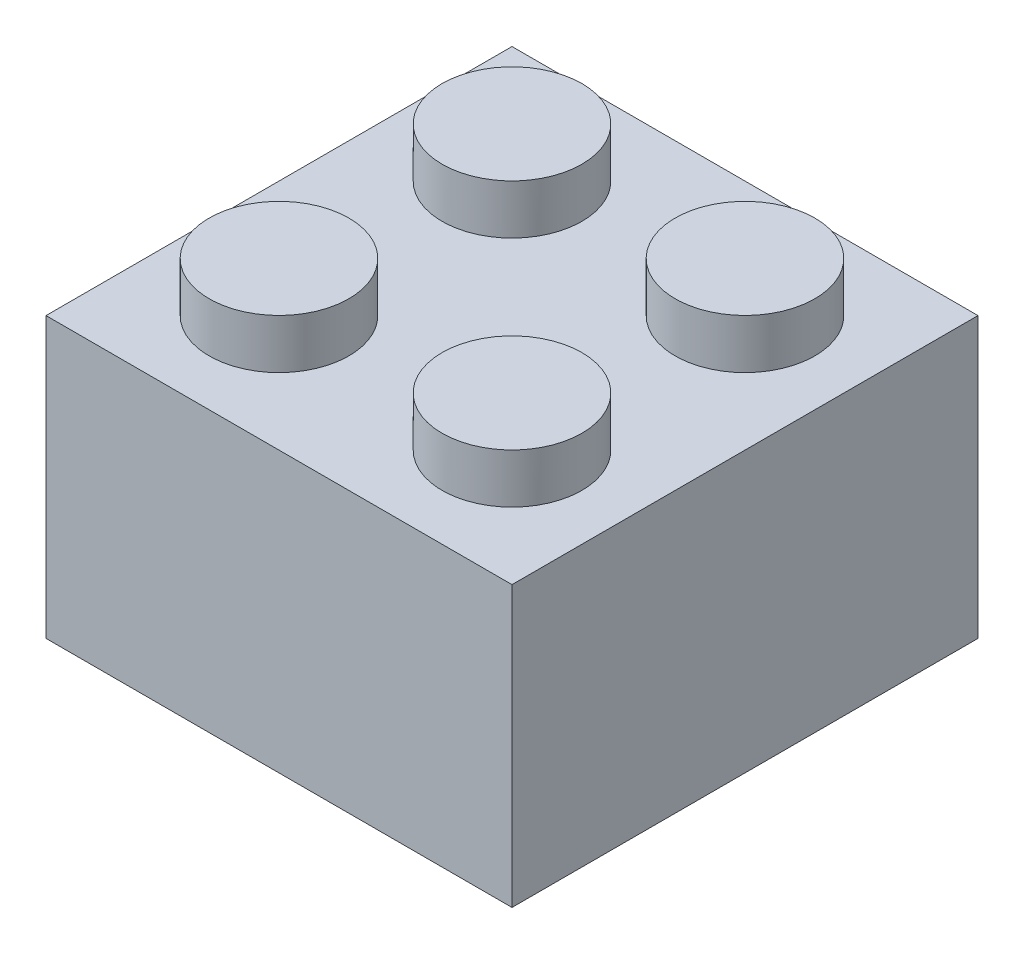
ISO-10303-21;
HEADER;
FILE_DESCRIPTION(('STEP AP214'),'2;1');
FILE_NAME('part.step','',(''),(''),'','','');
FILE_SCHEMA(('AUTOMOTIVE_DESIGN { 1 0 10303 214 1 1 1 1 }'));
ENDSEC;
DATA;
#1=APPLICATION_CONTEXT('core data for automotive mechanical design processes');
#2=APPLICATION_PROTOCOL_DEFINITION('international standard','automotive_design',2000,#1);
#3=PRODUCT_CONTEXT('',#1,'mechanical');
#4=PRODUCT('Part','Part','',(#3));
#5=PRODUCT_RELATED_PRODUCT_CATEGORY('part','',(#4));
#6=PRODUCT_DEFINITION_FORMATION('','',#4);
#7=PRODUCT_DEFINITION_CONTEXT('part definition',#1,'design');
#8=PRODUCT_DEFINITION('design','',#6,#7);
#9=PRODUCT_DEFINITION_SHAPE('','',#8);
#10=(LENGTH_UNIT() NAMED_UNIT(*) SI_UNIT(.MILLI.,.METRE.));
#11=(NAMED_UNIT(*) PLANE_ANGLE_UNIT() SI_UNIT($,.RADIAN.));
#12=(NAMED_UNIT(*) SI_UNIT($,.STERADIAN.) SOLID_ANGLE_UNIT());
#13=UNCERTAINTY_MEASURE_WITH_UNIT(LENGTH_MEASURE(1.E-05),#10,'distance_accuracy_value','');
#14=(GEOMETRIC_REPRESENTATION_CONTEXT(3) GLOBAL_UNCERTAINTY_ASSIGNED_CONTEXT((#13)) GLOBAL_UNIT_ASSIGNED_CONTEXT((#10,
#11,#12)) REPRESENTATION_CONTEXT('',''));
#15=CARTESIAN_POINT('',(0.,0.,0.));
#16=DIRECTION('',(0.,0.,1.));
#17=DIRECTION('',(1.,0.,0.));
#18=AXIS2_PLACEMENT_3D('',#15,#16,#17);
#19=CARTESIAN_POINT('',(0.,0.,0.));
#20=DIRECTION('',(0.,-1.,0.));
#21=DIRECTION('',(0.,0.,-1.));
#22=AXIS2_PLACEMENT_3D('',#19,#20,#21);
#23=PLANE('',#22);
#24=DIRECTION('',(0.,0.,-1.));
#25=VECTOR('',#24,1.);
#26=CARTESIAN_POINT('',(8.,0.,8.));
#27=LINE('',#26,#25);
#28=CARTESIAN_POINT('',(8.,0.,8.));
#29=VERTEX_POINT('',#28);
#30=CARTESIAN_POINT('',(8.,0.,-8.));
#31=VERTEX_POINT('',#30);
#32=EDGE_CURVE('E187',#29,#31,#27,.T.);
#33=ORIENTED_EDGE('',*,*,#32,.F.);
#34=DIRECTION('',(1.,0.,0.));
#35=VECTOR('',#34,1.);
#36=CARTESIAN_POINT('',(-8.,0.,8.));
#37=LINE('',#36,#35);
#38=CARTESIAN_POINT('',(-8.,0.,8.));
#39=VERTEX_POINT('',#38);
#40=EDGE_CURVE('E78',#39,#29,#37,.T.);
#41=ORIENTED_EDGE('',*,*,#40,.F.);
#42=DIRECTION('',(0.,0.,1.));
#43=VECTOR('',#42,1.);
#44=CARTESIAN_POINT('',(-8.,0.,8.));
#45=LINE('',#44,#43);
#46=CARTESIAN_POINT('',(-8.,0.,-8.));
#47=VERTEX_POINT('',#46);
#48=EDGE_CURVE('E199',#47,#39,#45,.T.);
#49=ORIENTED_EDGE('',*,*,#48,.F.);
#50=DIRECTION('',(-1.,0.,0.));
#51=VECTOR('',#50,1.);
#52=CARTESIAN_POINT('',(-8.,0.,-8.));
#53=LINE('',#52,#51);
#54=EDGE_CURVE('E197',#31,#47,#53,.T.);
#55=ORIENTED_EDGE('',*,*,#54,.F.);
#56=EDGE_LOOP('',(#33,#41,#49,#55));
#57=FACE_BOUND('',#56,.T.);
#58=DIRECTION('',(1.,0.,0.));
#59=VECTOR('',#58,1.);
#60=CARTESIAN_POINT('',(0.,0.,6.4));
#61=LINE('',#60,#59);
#62=CARTESIAN_POINT('',(-6.4,0.,6.4));
#63=VERTEX_POINT('',#62);
#64=CARTESIAN_POINT('',(6.4,0.,6.4));
#65=VERTEX_POINT('',#64);
#66=EDGE_CURVE('E126',#63,#65,#61,.T.);
#67=ORIENTED_EDGE('',*,*,#66,.T.);
#68=DIRECTION('',(0.,0.,-1.));
#69=VECTOR('',#68,1.);
#70=CARTESIAN_POINT('',(6.4,0.,0.));
#71=LINE('',#70,#69);
#72=CARTESIAN_POINT('',(6.4,0.,-6.4));
#73=VERTEX_POINT('',#72);
#74=EDGE_CURVE('E160',#65,#73,#71,.T.);
#75=ORIENTED_EDGE('',*,*,#74,.T.);
#76=DIRECTION('',(-1.,0.,0.));
#77=VECTOR('',#76,1.);
#78=CARTESIAN_POINT('',(0.,0.,-6.4));
#79=LINE('',#78,#77);
#80=CARTESIAN_POINT('',(-6.4,0.,-6.4));
#81=VERTEX_POINT('',#80);
#82=EDGE_CURVE('E130',#73,#81,#79,.T.);
#83=ORIENTED_EDGE('',*,*,#82,.T.);
#84=DIRECTION('',(0.,0.,1.));
#85=VECTOR('',#84,1.);
#86=CARTESIAN_POINT('',(-6.4,0.,0.));
#87=LINE('',#86,#85);
#88=EDGE_CURVE('E48',#81,#63,#87,.T.);
#89=ORIENTED_EDGE('',*,*,#88,.T.);
#90=EDGE_LOOP('',(#67,#75,#83,#89));
#91=FACE_BOUND('',#90,.T.);
#92=ADVANCED_FACE('F33',(#57,#91),#23,.T.);
#93=CARTESIAN_POINT('',(8.,9.6,8.));
#94=DIRECTION('',(-1.,0.,0.));
#95=DIRECTION('',(0.,0.,1.));
#96=AXIS2_PLACEMENT_3D('',#93,#94,#95);
#97=PLANE('',#96);
#98=ORIENTED_EDGE('',*,*,#32,.T.);
#99=DIRECTION('',(0.,-1.,0.));
#100=VECTOR('',#99,1.);
#101=CARTESIAN_POINT('',(8.,9.6,-8.));
#102=LINE('',#101,#100);
#103=CARTESIAN_POINT('',(8.,9.6,-8.));
#104=VERTEX_POINT('',#103);
#105=EDGE_CURVE('E208',#104,#31,#102,.T.);
#106=ORIENTED_EDGE('',*,*,#105,.F.);
#107=DIRECTION('',(0.,0.,-1.));
#108=VECTOR('',#107,1.);
#109=CARTESIAN_POINT('',(8.,9.6,8.));
#110=LINE('',#109,#108);
#111=CARTESIAN_POINT('',(8.,9.6,8.));
#112=VERTEX_POINT('',#111);
#113=EDGE_CURVE('E188',#112,#104,#110,.T.);
#114=ORIENTED_EDGE('',*,*,#113,.F.);
#115=DIRECTION('',(0.,-1.,0.));
#116=VECTOR('',#115,1.);
#117=CARTESIAN_POINT('',(8.,9.6,8.));
#118=LINE('',#117,#116);
#119=EDGE_CURVE('E194',#112,#29,#118,.T.);
#120=ORIENTED_EDGE('',*,*,#119,.T.);
#121=EDGE_LOOP('',(#98,#106,#114,#120));
#122=FACE_BOUND('',#121,.T.);
#123=ADVANCED_FACE('F35',(#122),#97,.F.);
#124=CARTESIAN_POINT('',(-8.,9.6,-8.));
#125=DIRECTION('',(0.,0.,1.));
#126=DIRECTION('',(1.,0.,0.));
#127=AXIS2_PLACEMENT_3D('',#124,#125,#126);
#128=PLANE('',#127);
#129=ORIENTED_EDGE('',*,*,#54,.T.);
#130=DIRECTION('',(0.,-1.,0.));
#131=VECTOR('',#130,1.);
#132=CARTESIAN_POINT('',(-8.,9.6,-8.));
#133=LINE('',#132,#131);
#134=CARTESIAN_POINT('',(-8.,9.6,-8.));
#135=VERTEX_POINT('',#134);
#136=EDGE_CURVE('E205',#135,#47,#133,.T.);
#137=ORIENTED_EDGE('',*,*,#136,.F.);
#138=DIRECTION('',(-1.,0.,0.));
#139=VECTOR('',#138,1.);
#140=CARTESIAN_POINT('',(-8.,9.6,-8.));
#141=LINE('',#140,#139);
#142=EDGE_CURVE('E86',#104,#135,#141,.T.);
#143=ORIENTED_EDGE('',*,*,#142,.F.);
#144=ORIENTED_EDGE('',*,*,#105,.T.);
#145=EDGE_LOOP('',(#129,#137,#143,#144));
#146=FACE_BOUND('',#145,.T.);
#147=ADVANCED_FACE('F238',(#146),#128,.F.);
#148=CARTESIAN_POINT('',(-8.,9.6,8.));
#149=DIRECTION('',(1.,0.,0.));
#150=DIRECTION('',(0.,0.,-1.));
#151=AXIS2_PLACEMENT_3D('',#148,#149,#150);
#152=PLANE('',#151);
#153=ORIENTED_EDGE('',*,*,#48,.T.);
#154=DIRECTION('',(0.,-1.,0.));
#155=VECTOR('',#154,1.);
#156=CARTESIAN_POINT('',(-8.,9.6,8.));
#157=LINE('',#156,#155);
#158=CARTESIAN_POINT('',(-8.,9.6,8.));
#159=VERTEX_POINT('',#158);
#160=EDGE_CURVE('E203',#159,#39,#157,.T.);
#161=ORIENTED_EDGE('',*,*,#160,.F.);
#162=DIRECTION('',(0.,0.,1.));
#163=VECTOR('',#162,1.);
#164=CARTESIAN_POINT('',(-8.,9.6,8.));
#165=LINE('',#164,#163);
#166=EDGE_CURVE('E191',#135,#159,#165,.T.);
#167=ORIENTED_EDGE('',*,*,#166,.F.);
#168=ORIENTED_EDGE('',*,*,#136,.T.);
#169=EDGE_LOOP('',(#153,#161,#167,#168));
#170=FACE_BOUND('',#169,.T.);
#171=ADVANCED_FACE('F243',(#170),#152,.F.);
#172=CARTESIAN_POINT('',(-8.,9.6,8.));
#173=DIRECTION('',(0.,0.,-1.));
#174=DIRECTION('',(-1.,0.,0.));
#175=AXIS2_PLACEMENT_3D('',#172,#173,#174);
#176=PLANE('',#175);
#177=ORIENTED_EDGE('',*,*,#40,.T.);
#178=ORIENTED_EDGE('',*,*,#119,.F.);
#179=DIRECTION('',(1.,0.,0.));
#180=VECTOR('',#179,1.);
#181=CARTESIAN_POINT('',(-8.,9.6,8.));
#182=LINE('',#181,#180);
#183=EDGE_CURVE('E57',#159,#112,#182,.T.);
#184=ORIENTED_EDGE('',*,*,#183,.F.);
#185=ORIENTED_EDGE('',*,*,#160,.T.);
#186=EDGE_LOOP('',(#177,#178,#184,#185));
#187=FACE_BOUND('',#186,.T.);
#188=ADVANCED_FACE('F227',(#187),#176,.F.);
#189=CARTESIAN_POINT('',(0.,9.6,0.));
#190=DIRECTION('',(0.,-1.,0.));
#191=DIRECTION('',(0.,0.,-1.));
#192=AXIS2_PLACEMENT_3D('',#189,#190,#191);
#193=PLANE('',#192);
#194=CARTESIAN_POINT('',(-4.,9.6,4.));
#195=DIRECTION('',(0.,-1.,0.));
#196=DIRECTION('',(0.,0.,-1.));
#197=AXIS2_PLACEMENT_3D('',#194,#195,#196);
#198=CIRCLE('',#197,2.4);
#199=CARTESIAN_POINT('',(-4.,9.6,1.6));
#200=VERTEX_POINT('',#199);
#201=EDGE_CURVE('E41',#200,#200,#198,.F.);
#202=ORIENTED_EDGE('',*,*,#201,.F.);
#203=EDGE_LOOP('',(#202));
#204=FACE_BOUND('',#203,.T.);
#205=CARTESIAN_POINT('',(4.,9.6,4.));
#206=DIRECTION('',(0.,-1.,0.));
#207=DIRECTION('',(0.,0.,-1.));
#208=AXIS2_PLACEMENT_3D('',#205,#206,#207);
#209=CIRCLE('',#208,2.4);
#210=CARTESIAN_POINT('',(4.,9.6,1.6));
#211=VERTEX_POINT('',#210);
#212=EDGE_CURVE('E216',#211,#211,#209,.F.);
#213=ORIENTED_EDGE('',*,*,#212,.F.);
#214=EDGE_LOOP('',(#213));
#215=FACE_BOUND('',#214,.T.);
#216=CARTESIAN_POINT('',(-4.,9.6,-4.));
#217=DIRECTION('',(0.,-1.,0.));
#218=DIRECTION('',(0.,0.,-1.));
#219=AXIS2_PLACEMENT_3D('',#216,#217,#218);
#220=CIRCLE('',#219,2.4);
#221=CARTESIAN_POINT('',(-4.,9.6,-6.4));
#222=VERTEX_POINT('',#221);
#223=EDGE_CURVE('E213',#222,#222,#220,.F.);
#224=ORIENTED_EDGE('',*,*,#223,.F.);
#225=EDGE_LOOP('',(#224));
#226=FACE_BOUND('',#225,.T.);
#227=CARTESIAN_POINT('',(4.,9.6,-4.));
#228=DIRECTION('',(0.,-1.,0.));
#229=DIRECTION('',(0.,0.,-1.));
#230=AXIS2_PLACEMENT_3D('',#227,#228,#229);
#231=CIRCLE('',#230,2.4);
#232=CARTESIAN_POINT('',(4.,9.6,-6.4));
#233=VERTEX_POINT('',#232);
#234=EDGE_CURVE('E210',#233,#233,#231,.F.);
#235=ORIENTED_EDGE('',*,*,#234,.F.);
#236=EDGE_LOOP('',(#235));
#237=FACE_BOUND('',#236,.T.);
#238=ORIENTED_EDGE('',*,*,#113,.T.);
#239=ORIENTED_EDGE('',*,*,#142,.T.);
#240=ORIENTED_EDGE('',*,*,#166,.T.);
#241=ORIENTED_EDGE('',*,*,#183,.T.);
#242=EDGE_LOOP('',(#238,#239,#240,#241));
#243=FACE_BOUND('',#242,.T.);
#244=ADVANCED_FACE('F223',(#204,#215,#226,#237,#243),#193,.F.);
#245=CARTESIAN_POINT('',(4.,11.3,-4.));
#246=DIRECTION('',(0.,-1.,0.));
#247=DIRECTION('',(0.,0.,-1.));
#248=AXIS2_PLACEMENT_3D('',#245,#246,#247);
#249=CYLINDRICAL_SURFACE('',#248,2.4);
#250=CARTESIAN_POINT('',(4.,11.3,-4.));
#251=DIRECTION('',(0.,1.,0.));
#252=DIRECTION('',(0.,0.,-1.));
#253=AXIS2_PLACEMENT_3D('',#250,#251,#252);
#254=CIRCLE('',#253,2.4);
#255=CARTESIAN_POINT('',(4.,11.3,-6.4));
#256=VERTEX_POINT('',#255);
#257=EDGE_CURVE('E184',#256,#256,#254,.T.);
#258=ORIENTED_EDGE('',*,*,#257,.F.);
#259=EDGE_LOOP('',(#258));
#260=FACE_BOUND('',#259,.T.);
#261=ORIENTED_EDGE('',*,*,#234,.T.);
#262=EDGE_LOOP('',(#261));
#263=FACE_BOUND('',#262,.T.);
#264=ADVANCED_FACE('F226',(#260,#263),#249,.T.);
#265=CARTESIAN_POINT('',(4.,11.3,-4.));
#266=DIRECTION('',(0.,-1.,0.));
#267=DIRECTION('',(0.,0.,-1.));
#268=AXIS2_PLACEMENT_3D('',#265,#266,#267);
#269=PLANE('',#268);
#270=ORIENTED_EDGE('',*,*,#257,.T.);
#271=EDGE_LOOP('',(#270));
#272=FACE_BOUND('',#271,.T.);
#273=ADVANCED_FACE('F322',(#272),#269,.F.);
#274=CARTESIAN_POINT('',(-4.,11.3,-4.));
#275=DIRECTION('',(0.,-1.,0.));
#276=DIRECTION('',(0.,0.,-1.));
#277=AXIS2_PLACEMENT_3D('',#274,#275,#276);
#278=CYLINDRICAL_SURFACE('',#277,2.4);
#279=CARTESIAN_POINT('',(-4.,11.3,-4.));
#280=DIRECTION('',(0.,1.,0.));
#281=DIRECTION('',(0.,0.,1.));
#282=AXIS2_PLACEMENT_3D('',#279,#280,#281);
#283=CIRCLE('',#282,2.4);
#284=CARTESIAN_POINT('',(-4.,11.3,-1.6));
#285=VERTEX_POINT('',#284);
#286=EDGE_CURVE('E181',#285,#285,#283,.T.);
#287=ORIENTED_EDGE('',*,*,#286,.F.);
#288=EDGE_LOOP('',(#287));
#289=FACE_BOUND('',#288,.T.);
#290=ORIENTED_EDGE('',*,*,#223,.T.);
#291=EDGE_LOOP('',(#290));
#292=FACE_BOUND('',#291,.T.);
#293=ADVANCED_FACE('F318',(#289,#292),#278,.T.);
#294=CARTESIAN_POINT('',(-4.,11.3,-4.));
#295=DIRECTION('',(0.,1.,0.));
#296=DIRECTION('',(0.,0.,1.));
#297=AXIS2_PLACEMENT_3D('',#294,#295,#296);
#298=PLANE('',#297);
#299=ORIENTED_EDGE('',*,*,#286,.T.);
#300=EDGE_LOOP('',(#299));
#301=FACE_BOUND('',#300,.T.);
#302=ADVANCED_FACE('F314',(#301),#298,.T.);
#303=CARTESIAN_POINT('',(4.,11.3,4.));
#304=DIRECTION('',(0.,-1.,0.));
#305=DIRECTION('',(0.,0.,-1.));
#306=AXIS2_PLACEMENT_3D('',#303,#304,#305);
#307=CYLINDRICAL_SURFACE('',#306,2.4);
#308=CARTESIAN_POINT('',(4.,11.3,4.));
#309=DIRECTION('',(0.,1.,0.));
#310=DIRECTION('',(0.,0.,1.));
#311=AXIS2_PLACEMENT_3D('',#308,#309,#310);
#312=CIRCLE('',#311,2.4);
#313=CARTESIAN_POINT('',(4.,11.3,6.4));
#314=VERTEX_POINT('',#313);
#315=EDGE_CURVE('E178',#314,#314,#312,.T.);
#316=ORIENTED_EDGE('',*,*,#315,.F.);
#317=EDGE_LOOP('',(#316));
#318=FACE_BOUND('',#317,.T.);
#319=ORIENTED_EDGE('',*,*,#212,.T.);
#320=EDGE_LOOP('',(#319));
#321=FACE_BOUND('',#320,.T.);
#322=ADVANCED_FACE('F310',(#318,#321),#307,.T.);
#323=CARTESIAN_POINT('',(4.,11.3,4.));
#324=DIRECTION('',(0.,1.,0.));
#325=DIRECTION('',(0.,0.,1.));
#326=AXIS2_PLACEMENT_3D('',#323,#324,#325);
#327=PLANE('',#326);
#328=ORIENTED_EDGE('',*,*,#315,.T.);
#329=EDGE_LOOP('',(#328));
#330=FACE_BOUND('',#329,.T.);
#331=ADVANCED_FACE('F306',(#330),#327,.T.);
#332=CARTESIAN_POINT('',(-4.,11.3,4.));
#333=DIRECTION('',(0.,-1.,0.));
#334=DIRECTION('',(0.,0.,-1.));
#335=AXIS2_PLACEMENT_3D('',#332,#333,#334);
#336=CYLINDRICAL_SURFACE('',#335,2.4);
#337=CARTESIAN_POINT('',(-4.,11.3,4.));
#338=DIRECTION('',(0.,1.,0.));
#339=DIRECTION('',(0.,0.,-1.));
#340=AXIS2_PLACEMENT_3D('',#337,#338,#339);
#341=CIRCLE('',#340,2.4);
#342=CARTESIAN_POINT('',(-4.,11.3,1.6));
#343=VERTEX_POINT('',#342);
#344=EDGE_CURVE('E151',#343,#343,#341,.T.);
#345=ORIENTED_EDGE('',*,*,#344,.F.);
#346=EDGE_LOOP('',(#345));
#347=FACE_BOUND('',#346,.T.);
#348=ORIENTED_EDGE('',*,*,#201,.T.);
#349=EDGE_LOOP('',(#348));
#350=FACE_BOUND('',#349,.T.);
#351=ADVANCED_FACE('F221',(#347,#350),#336,.T.);
#352=CARTESIAN_POINT('',(-4.,11.3,4.));
#353=DIRECTION('',(0.,-1.,0.));
#354=DIRECTION('',(0.,0.,-1.));
#355=AXIS2_PLACEMENT_3D('',#352,#353,#354);
#356=PLANE('',#355);
#357=ORIENTED_EDGE('',*,*,#344,.T.);
#358=EDGE_LOOP('',(#357));
#359=FACE_BOUND('',#358,.T.);
#360=ADVANCED_FACE('F300',(#359),#356,.F.);
#361=CARTESIAN_POINT('',(6.4,9.6,8.));
#362=DIRECTION('',(-1.,0.,0.));
#363=DIRECTION('',(0.,0.,1.));
#364=AXIS2_PLACEMENT_3D('',#361,#362,#363);
#365=PLANE('',#364);
#366=ORIENTED_EDGE('',*,*,#74,.F.);
#367=DIRECTION('',(0.,-1.,0.));
#368=VECTOR('',#367,1.);
#369=CARTESIAN_POINT('',(6.4,9.6,6.4));
#370=LINE('',#369,#368);
#371=CARTESIAN_POINT('',(6.4,8.,6.4));
#372=VERTEX_POINT('',#371);
#373=EDGE_CURVE('E125',#372,#65,#370,.T.);
#374=ORIENTED_EDGE('',*,*,#373,.F.);
#375=DIRECTION('',(0.,0.,-1.));
#376=VECTOR('',#375,1.);
#377=CARTESIAN_POINT('',(6.4,8.,0.));
#378=LINE('',#377,#376);
#379=CARTESIAN_POINT('',(6.4,8.,-6.4));
#380=VERTEX_POINT('',#379);
#381=EDGE_CURVE('E113',#372,#380,#378,.T.);
#382=ORIENTED_EDGE('',*,*,#381,.T.);
#383=DIRECTION('',(0.,-1.,0.));
#384=VECTOR('',#383,1.);
#385=CARTESIAN_POINT('',(6.4,9.6,-6.4));
#386=LINE('',#385,#384);
#387=EDGE_CURVE('E123',#380,#73,#386,.T.);
#388=ORIENTED_EDGE('',*,*,#387,.T.);
#389=EDGE_LOOP('',(#366,#374,#382,#388));
#390=FACE_BOUND('',#389,.T.);
#391=ADVANCED_FACE('F122',(#390),#365,.T.);
#392=CARTESIAN_POINT('',(-8.,9.6,-6.4));
#393=DIRECTION('',(0.,0.,1.));
#394=DIRECTION('',(1.,0.,0.));
#395=AXIS2_PLACEMENT_3D('',#392,#393,#394);
#396=PLANE('',#395);
#397=ORIENTED_EDGE('',*,*,#82,.F.);
#398=ORIENTED_EDGE('',*,*,#387,.F.);
#399=DIRECTION('',(-1.,0.,0.));
#400=VECTOR('',#399,1.);
#401=CARTESIAN_POINT('',(0.,8.,-6.4));
#402=LINE('',#401,#400);
#403=CARTESIAN_POINT('',(-6.4,8.,-6.4));
#404=VERTEX_POINT('',#403);
#405=EDGE_CURVE('E109',#380,#404,#402,.T.);
#406=ORIENTED_EDGE('',*,*,#405,.T.);
#407=DIRECTION('',(0.,-1.,0.));
#408=VECTOR('',#407,1.);
#409=CARTESIAN_POINT('',(-6.4,9.6,-6.4));
#410=LINE('',#409,#408);
#411=EDGE_CURVE('E132',#404,#81,#410,.T.);
#412=ORIENTED_EDGE('',*,*,#411,.T.);
#413=EDGE_LOOP('',(#397,#398,#406,#412));
#414=FACE_BOUND('',#413,.T.);
#415=ADVANCED_FACE('F128',(#414),#396,.T.);
#416=CARTESIAN_POINT('',(-6.4,9.6,8.));
#417=DIRECTION('',(1.,0.,0.));
#418=DIRECTION('',(0.,0.,-1.));
#419=AXIS2_PLACEMENT_3D('',#416,#417,#418);
#420=PLANE('',#419);
#421=ORIENTED_EDGE('',*,*,#88,.F.);
#422=ORIENTED_EDGE('',*,*,#411,.F.);
#423=DIRECTION('',(0.,0.,1.));
#424=VECTOR('',#423,1.);
#425=CARTESIAN_POINT('',(-6.4,8.,0.));
#426=LINE('',#425,#424);
#427=CARTESIAN_POINT('',(-6.4,8.,6.4));
#428=VERTEX_POINT('',#427);
#429=EDGE_CURVE('E114',#404,#428,#426,.T.);
#430=ORIENTED_EDGE('',*,*,#429,.T.);
#431=DIRECTION('',(0.,-1.,0.));
#432=VECTOR('',#431,1.);
#433=CARTESIAN_POINT('',(-6.4,9.6,6.4));
#434=LINE('',#433,#432);
#435=EDGE_CURVE('E137',#428,#63,#434,.T.);
#436=ORIENTED_EDGE('',*,*,#435,.T.);
#437=EDGE_LOOP('',(#421,#422,#430,#436));
#438=FACE_BOUND('',#437,.T.);
#439=ADVANCED_FACE('F252',(#438),#420,.T.);
#440=CARTESIAN_POINT('',(-8.,9.6,6.4));
#441=DIRECTION('',(0.,0.,-1.));
#442=DIRECTION('',(-1.,0.,0.));
#443=AXIS2_PLACEMENT_3D('',#440,#441,#442);
#444=PLANE('',#443);
#445=ORIENTED_EDGE('',*,*,#66,.F.);
#446=ORIENTED_EDGE('',*,*,#435,.F.);
#447=DIRECTION('',(1.,0.,0.));
#448=VECTOR('',#447,1.);
#449=CARTESIAN_POINT('',(0.,8.,6.4));
#450=LINE('',#449,#448);
#451=EDGE_CURVE('E143',#428,#372,#450,.T.);
#452=ORIENTED_EDGE('',*,*,#451,.T.);
#453=ORIENTED_EDGE('',*,*,#373,.T.);
#454=EDGE_LOOP('',(#445,#446,#452,#453));
#455=FACE_BOUND('',#454,.T.);
#456=ADVANCED_FACE('F251',(#455),#444,.T.);
#457=CARTESIAN_POINT('',(0.,8.,0.));
#458=DIRECTION('',(0.,-1.,0.));
#459=DIRECTION('',(0.,0.,-1.));
#460=AXIS2_PLACEMENT_3D('',#457,#458,#459);
#461=PLANE('',#460);
#462=CARTESIAN_POINT('',(0.,8.,0.));
#463=DIRECTION('',(0.,-1.,0.));
#464=DIRECTION('',(0.,0.,-1.));
#465=AXIS2_PLACEMENT_3D('',#462,#463,#464);
#466=CIRCLE('',#465,3.255);
#467=CARTESIAN_POINT('',(0.,8.,-3.255));
#468=VERTEX_POINT('',#467);
#469=EDGE_CURVE('E469',#468,#468,#466,.T.);
#470=ORIENTED_EDGE('',*,*,#469,.F.);
#471=EDGE_LOOP('',(#470));
#472=FACE_BOUND('',#471,.T.);
#473=CARTESIAN_POINT('',(-4.,8.,4.));
#474=DIRECTION('',(0.,-1.,0.));
#475=DIRECTION('',(0.,0.,-1.));
#476=AXIS2_PLACEMENT_3D('',#473,#474,#475);
#477=CIRCLE('',#476,0.8);
#478=CARTESIAN_POINT('',(-4.,8.,3.2));
#479=VERTEX_POINT('',#478);
#480=EDGE_CURVE('E148',#479,#479,#477,.F.);
#481=ORIENTED_EDGE('',*,*,#480,.T.);
#482=EDGE_LOOP('',(#481));
#483=FACE_BOUND('',#482,.T.);
#484=CARTESIAN_POINT('',(4.,8.,4.));
#485=DIRECTION('',(0.,-1.,0.));
#486=DIRECTION('',(0.,0.,-1.));
#487=AXIS2_PLACEMENT_3D('',#484,#485,#486);
#488=CIRCLE('',#487,0.8);
#489=CARTESIAN_POINT('',(4.,8.,3.2));
#490=VERTEX_POINT('',#489);
#491=EDGE_CURVE('E152',#490,#490,#488,.F.);
#492=ORIENTED_EDGE('',*,*,#491,.T.);
#493=EDGE_LOOP('',(#492));
#494=FACE_BOUND('',#493,.T.);
#495=CARTESIAN_POINT('',(-4.,8.,-4.));
#496=DIRECTION('',(0.,-1.,0.));
#497=DIRECTION('',(0.,0.,-1.));
#498=AXIS2_PLACEMENT_3D('',#495,#496,#497);
#499=CIRCLE('',#498,0.8);
#500=CARTESIAN_POINT('',(-4.,8.,-4.8));
#501=VERTEX_POINT('',#500);
#502=EDGE_CURVE('E135',#501,#501,#499,.F.);
#503=ORIENTED_EDGE('',*,*,#502,.T.);
#504=EDGE_LOOP('',(#503));
#505=FACE_BOUND('',#504,.T.);
#506=CARTESIAN_POINT('',(4.,8.,-4.));
#507=DIRECTION('',(0.,-1.,0.));
#508=DIRECTION('',(0.,0.,-1.));
#509=AXIS2_PLACEMENT_3D('',#506,#507,#508);
#510=CIRCLE('',#509,0.8);
#511=CARTESIAN_POINT('',(4.,8.,-4.8));
#512=VERTEX_POINT('',#511);
#513=EDGE_CURVE('E131',#512,#512,#510,.F.);
#514=ORIENTED_EDGE('',*,*,#513,.T.);
#515=EDGE_LOOP('',(#514));
#516=FACE_BOUND('',#515,.T.);
#517=ORIENTED_EDGE('',*,*,#381,.F.);
#518=ORIENTED_EDGE('',*,*,#451,.F.);
#519=ORIENTED_EDGE('',*,*,#429,.F.);
#520=ORIENTED_EDGE('',*,*,#405,.F.);
#521=EDGE_LOOP('',(#517,#518,#519,#520));
#522=FACE_BOUND('',#521,.T.);
#523=ADVANCED_FACE('F111',(#472,#483,#494,#505,#516,#522),#461,.T.);
#524=CARTESIAN_POINT('',(4.,11.3,-4.));
#525=DIRECTION('',(0.,-1.,0.));
#526=DIRECTION('',(0.,0.,-1.));
#527=AXIS2_PLACEMENT_3D('',#524,#525,#526);
#528=CYLINDRICAL_SURFACE('',#527,0.8);
#529=CARTESIAN_POINT('',(4.,9.7,-4.));
#530=DIRECTION('',(0.,-1.,0.));
#531=DIRECTION('',(0.,0.,-1.));
#532=AXIS2_PLACEMENT_3D('',#529,#530,#531);
#533=CIRCLE('',#532,0.8);
#534=CARTESIAN_POINT('',(4.,9.7,-4.8));
#535=VERTEX_POINT('',#534);
#536=EDGE_CURVE('E157',#535,#535,#533,.F.);
#537=ORIENTED_EDGE('',*,*,#536,.T.);
#538=EDGE_LOOP('',(#537));
#539=FACE_BOUND('',#538,.T.);
#540=ORIENTED_EDGE('',*,*,#513,.F.);
#541=EDGE_LOOP('',(#540));
#542=FACE_BOUND('',#541,.T.);
#543=ADVANCED_FACE('F265',(#539,#542),#528,.F.);
#544=CARTESIAN_POINT('',(4.,9.7,-4.));
#545=DIRECTION('',(0.,-1.,0.));
#546=DIRECTION('',(0.,0.,-1.));
#547=AXIS2_PLACEMENT_3D('',#544,#545,#546);
#548=PLANE('',#547);
#549=ORIENTED_EDGE('',*,*,#536,.F.);
#550=EDGE_LOOP('',(#549));
#551=FACE_BOUND('',#550,.T.);
#552=ADVANCED_FACE('F270',(#551),#548,.T.);
#553=CARTESIAN_POINT('',(-4.,11.3,-4.));
#554=DIRECTION('',(0.,-1.,0.));
#555=DIRECTION('',(0.,0.,-1.));
#556=AXIS2_PLACEMENT_3D('',#553,#554,#555);
#557=CYLINDRICAL_SURFACE('',#556,0.8);
#558=CARTESIAN_POINT('',(-4.,9.7,-4.));
#559=DIRECTION('',(0.,1.,0.));
#560=DIRECTION('',(0.,0.,1.));
#561=AXIS2_PLACEMENT_3D('',#558,#559,#560);
#562=CIRCLE('',#561,0.8);
#563=CARTESIAN_POINT('',(-4.,9.7,-3.2));
#564=VERTEX_POINT('',#563);
#565=EDGE_CURVE('E161',#564,#564,#562,.T.);
#566=ORIENTED_EDGE('',*,*,#565,.T.);
#567=EDGE_LOOP('',(#566));
#568=FACE_BOUND('',#567,.T.);
#569=ORIENTED_EDGE('',*,*,#502,.F.);
#570=EDGE_LOOP('',(#569));
#571=FACE_BOUND('',#570,.T.);
#572=ADVANCED_FACE('F274',(#568,#571),#557,.F.);
#573=CARTESIAN_POINT('',(-4.,9.7,-4.));
#574=DIRECTION('',(0.,1.,0.));
#575=DIRECTION('',(0.,0.,1.));
#576=AXIS2_PLACEMENT_3D('',#573,#574,#575);
#577=PLANE('',#576);
#578=ORIENTED_EDGE('',*,*,#565,.F.);
#579=EDGE_LOOP('',(#578));
#580=FACE_BOUND('',#579,.T.);
#581=ADVANCED_FACE('F278',(#580),#577,.F.);
#582=CARTESIAN_POINT('',(4.,11.3,4.));
#583=DIRECTION('',(0.,-1.,0.));
#584=DIRECTION('',(0.,0.,-1.));
#585=AXIS2_PLACEMENT_3D('',#582,#583,#584);
#586=CYLINDRICAL_SURFACE('',#585,0.8);
#587=CARTESIAN_POINT('',(4.,9.7,4.));
#588=DIRECTION('',(0.,1.,0.));
#589=DIRECTION('',(0.,0.,1.));
#590=AXIS2_PLACEMENT_3D('',#587,#588,#589);
#591=CIRCLE('',#590,0.8);
#592=CARTESIAN_POINT('',(4.,9.7,4.8));
#593=VERTEX_POINT('',#592);
#594=EDGE_CURVE('E164',#593,#593,#591,.T.);
#595=ORIENTED_EDGE('',*,*,#594,.T.);
#596=EDGE_LOOP('',(#595));
#597=FACE_BOUND('',#596,.T.);
#598=ORIENTED_EDGE('',*,*,#491,.F.);
#599=EDGE_LOOP('',(#598));
#600=FACE_BOUND('',#599,.T.);
#601=ADVANCED_FACE('F282',(#597,#600),#586,.F.);
#602=CARTESIAN_POINT('',(4.,9.7,4.));
#603=DIRECTION('',(0.,1.,0.));
#604=DIRECTION('',(0.,0.,1.));
#605=AXIS2_PLACEMENT_3D('',#602,#603,#604);
#606=PLANE('',#605);
#607=ORIENTED_EDGE('',*,*,#594,.F.);
#608=EDGE_LOOP('',(#607));
#609=FACE_BOUND('',#608,.T.);
#610=ADVANCED_FACE('F286',(#609),#606,.F.);
#611=CARTESIAN_POINT('',(-4.,11.3,4.));
#612=DIRECTION('',(0.,-1.,0.));
#613=DIRECTION('',(0.,0.,-1.));
#614=AXIS2_PLACEMENT_3D('',#611,#612,#613);
#615=CYLINDRICAL_SURFACE('',#614,0.8);
#616=CARTESIAN_POINT('',(-4.,9.7,4.));
#617=DIRECTION('',(0.,-1.,0.));
#618=DIRECTION('',(0.,0.,-1.));
#619=AXIS2_PLACEMENT_3D('',#616,#617,#618);
#620=CIRCLE('',#619,0.8);
#621=CARTESIAN_POINT('',(-4.,9.7,3.2));
#622=VERTEX_POINT('',#621);
#623=EDGE_CURVE('E167',#622,#622,#620,.F.);
#624=ORIENTED_EDGE('',*,*,#623,.T.);
#625=EDGE_LOOP('',(#624));
#626=FACE_BOUND('',#625,.T.);
#627=ORIENTED_EDGE('',*,*,#480,.F.);
#628=EDGE_LOOP('',(#627));
#629=FACE_BOUND('',#628,.T.);
#630=ADVANCED_FACE('F290',(#626,#629),#615,.F.);
#631=CARTESIAN_POINT('',(-4.,9.7,4.));
#632=DIRECTION('',(0.,-1.,0.));
#633=DIRECTION('',(0.,0.,-1.));
#634=AXIS2_PLACEMENT_3D('',#631,#632,#633);
#635=PLANE('',#634);
#636=ORIENTED_EDGE('',*,*,#623,.F.);
#637=EDGE_LOOP('',(#636));
#638=FACE_BOUND('',#637,.T.);
#639=ADVANCED_FACE('F294',(#638),#635,.T.);
#640=CARTESIAN_POINT('',(0.,-9.20653029104885,0.));
#641=DIRECTION('',(0.,1.,0.));
#642=DIRECTION('',(0.,0.,1.));
#643=AXIS2_PLACEMENT_3D('',#640,#641,#642);
#644=CYLINDRICAL_SURFACE('',#643,3.255);
#645=ORIENTED_EDGE('',*,*,#469,.T.);
#646=EDGE_LOOP('',(#645));
#647=FACE_BOUND('',#646,.T.);
#648=CARTESIAN_POINT('',(0.,0.,0.));
#649=DIRECTION('',(0.,-1.,0.));
#650=DIRECTION('',(0.,0.,-1.));
#651=AXIS2_PLACEMENT_3D('',#648,#649,#650);
#652=CIRCLE('',#651,3.255);
#653=CARTESIAN_POINT('',(0.,0.,-3.255));
#654=VERTEX_POINT('',#653);
#655=EDGE_CURVE('E170',#654,#654,#652,.T.);
#656=ORIENTED_EDGE('',*,*,#655,.F.);
#657=EDGE_LOOP('',(#656));
#658=FACE_BOUND('',#657,.T.);
#659=ADVANCED_FACE('F298',(#647,#658),#644,.T.);
#660=CARTESIAN_POINT('',(0.,-9.20653029104885,0.));
#661=DIRECTION('',(0.,1.,0.));
#662=DIRECTION('',(0.,0.,1.));
#663=AXIS2_PLACEMENT_3D('',#660,#661,#662);
#664=CYLINDRICAL_SURFACE('',#663,2.4);
#665=CARTESIAN_POINT('',(0.,8.,0.));
#666=DIRECTION('',(0.,-1.,0.));
#667=DIRECTION('',(0.,0.,-1.));
#668=AXIS2_PLACEMENT_3D('',#665,#666,#667);
#669=CIRCLE('',#668,2.4);
#670=CARTESIAN_POINT('',(0.,8.,-2.4));
#671=VERTEX_POINT('',#670);
#672=EDGE_CURVE('E11',#671,#671,#669,.F.);
#673=ORIENTED_EDGE('',*,*,#672,.T.);
#674=EDGE_LOOP('',(#673));
#675=FACE_BOUND('',#674,.T.);
#676=CARTESIAN_POINT('',(0.,0.,0.));
#677=DIRECTION('',(0.,-1.,0.));
#678=DIRECTION('',(0.,0.,-1.));
#679=AXIS2_PLACEMENT_3D('',#676,#677,#678);
#680=CIRCLE('',#679,2.4);
#681=CARTESIAN_POINT('',(0.,0.,-2.4));
#682=VERTEX_POINT('',#681);
#683=EDGE_CURVE('E140',#682,#682,#680,.T.);
#684=ORIENTED_EDGE('',*,*,#683,.T.);
#685=EDGE_LOOP('',(#684));
#686=FACE_BOUND('',#685,.T.);
#687=ADVANCED_FACE('F434',(#675,#686),#664,.F.);
#688=CARTESIAN_POINT('',(0.,0.,0.));
#689=DIRECTION('',(0.,-1.,0.));
#690=DIRECTION('',(0.,0.,-1.));
#691=AXIS2_PLACEMENT_3D('',#688,#689,#690);
#692=PLANE('',#691);
#693=ORIENTED_EDGE('',*,*,#683,.F.);
#694=EDGE_LOOP('',(#693));
#695=FACE_BOUND('',#694,.T.);
#696=ORIENTED_EDGE('',*,*,#655,.T.);
#697=EDGE_LOOP('',(#696));
#698=FACE_BOUND('',#697,.T.);
#699=ADVANCED_FACE('F444',(#695,#698),#692,.T.);
#700=ORIENTED_EDGE('',*,*,#672,.F.);
#701=EDGE_LOOP('',(#700));
#702=FACE_BOUND('',#701,.T.);
#703=ADVANCED_FACE('F267',(#702),#461,.T.);
#704=CLOSED_SHELL('',(#92,#123,#147,#171,#188,#244,#264,#273,#293,#302,#322,#331,#351,#360,#391,
#415,#439,#456,#523,#543,#552,#572,#581,#601,#610,#630,#639,#659,#687,#699,#703));
#705=MANIFOLD_SOLID_BREP('B2',#704);
#706=ADVANCED_BREP_SHAPE_REPRESENTATION('',(#18,#705),#14);
#707=SHAPE_DEFINITION_REPRESENTATION(#9,#706);
ENDSEC;
END-ISO-10303-21;
